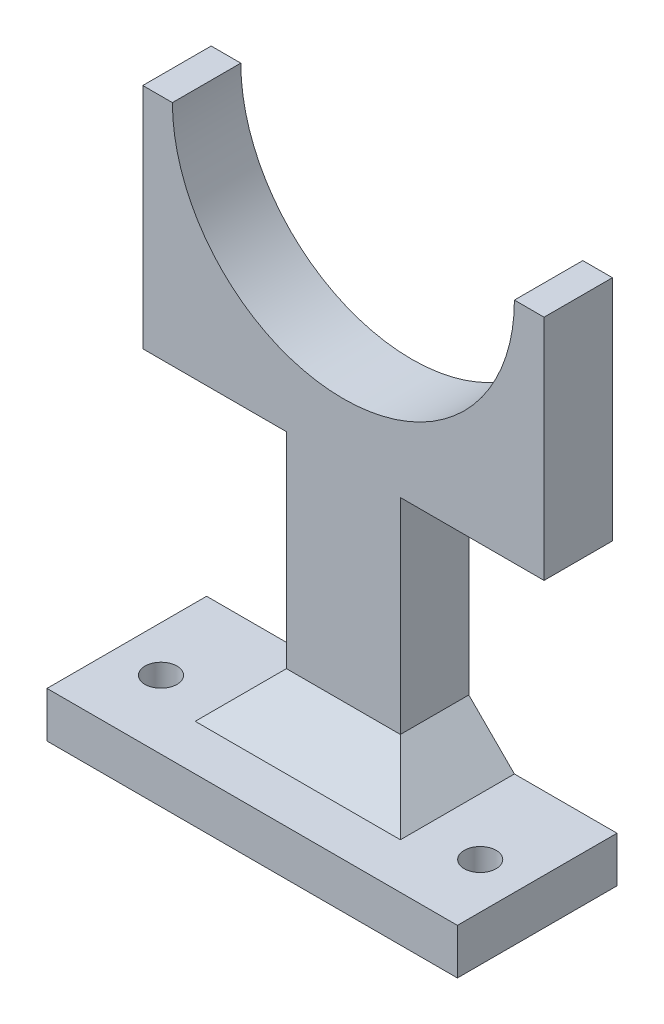
ISO-10303-21;
HEADER;
FILE_DESCRIPTION(('STEP AP214'),'2;1');
FILE_NAME('part.step','',(''),(''),'','','');
FILE_SCHEMA(('AUTOMOTIVE_DESIGN { 1 0 10303 214 1 1 1 1 }'));
ENDSEC;
DATA;
#1=APPLICATION_CONTEXT('core data for automotive mechanical design processes');
#2=APPLICATION_PROTOCOL_DEFINITION('international standard','automotive_design',2000,#1);
#3=PRODUCT_CONTEXT('',#1,'mechanical');
#4=PRODUCT('Part','Part','',(#3));
#5=PRODUCT_RELATED_PRODUCT_CATEGORY('part','',(#4));
#6=PRODUCT_DEFINITION_FORMATION('','',#4);
#7=PRODUCT_DEFINITION_CONTEXT('part definition',#1,'design');
#8=PRODUCT_DEFINITION('design','',#6,#7);
#9=PRODUCT_DEFINITION_SHAPE('','',#8);
#10=(LENGTH_UNIT() NAMED_UNIT(*) SI_UNIT(.MILLI.,.METRE.));
#11=(NAMED_UNIT(*) PLANE_ANGLE_UNIT() SI_UNIT($,.RADIAN.));
#12=(NAMED_UNIT(*) SI_UNIT($,.STERADIAN.) SOLID_ANGLE_UNIT());
#13=UNCERTAINTY_MEASURE_WITH_UNIT(LENGTH_MEASURE(1.E-05),#10,'distance_accuracy_value','');
#14=(GEOMETRIC_REPRESENTATION_CONTEXT(3) GLOBAL_UNCERTAINTY_ASSIGNED_CONTEXT((#13)) GLOBAL_UNIT_ASSIGNED_CONTEXT((#10,
#11,#12)) REPRESENTATION_CONTEXT('',''));
#15=CARTESIAN_POINT('',(0.,0.,0.));
#16=DIRECTION('',(0.,0.,1.));
#17=DIRECTION('',(1.,0.,0.));
#18=AXIS2_PLACEMENT_3D('',#15,#16,#17);
#19=CARTESIAN_POINT('',(16.6295045045046,-40.5,20.));
#20=DIRECTION('',(0.,1.,0.));
#21=DIRECTION('',(0.,0.,1.));
#22=AXIS2_PLACEMENT_3D('',#19,#20,#21);
#23=CYLINDRICAL_SURFACE('',#22,2.);
#24=CARTESIAN_POINT('',(16.6295045045046,-40.5,20.));
#25=DIRECTION('',(0.,1.,0.));
#26=DIRECTION('',(0.,0.,1.));
#27=AXIS2_PLACEMENT_3D('',#24,#25,#26);
#28=CIRCLE('',#27,2.);
#29=CARTESIAN_POINT('',(16.6295045045046,-40.5,22.));
#30=VERTEX_POINT('',#29);
#31=EDGE_CURVE('E190',#30,#30,#28,.T.);
#32=ORIENTED_EDGE('',*,*,#31,.F.);
#33=EDGE_LOOP('',(#32));
#34=FACE_BOUND('',#33,.T.);
#35=CARTESIAN_POINT('',(16.6295045045046,-37.5,20.));
#36=DIRECTION('',(0.,1.,0.));
#37=DIRECTION('',(0.,0.,1.));
#38=AXIS2_PLACEMENT_3D('',#35,#36,#37);
#39=CIRCLE('',#38,2.);
#40=CARTESIAN_POINT('',(16.6295045045046,-37.5,22.));
#41=VERTEX_POINT('',#40);
#42=EDGE_CURVE('E44',#41,#41,#39,.F.);
#43=ORIENTED_EDGE('',*,*,#42,.F.);
#44=EDGE_LOOP('',(#43));
#45=FACE_BOUND('',#44,.T.);
#46=ADVANCED_FACE('F40',(#34,#45),#23,.F.);
#47=CARTESIAN_POINT('',(-53.3704954954954,-40.5,20.));
#48=DIRECTION('',(0.,1.,0.));
#49=DIRECTION('',(0.,0.,1.));
#50=AXIS2_PLACEMENT_3D('',#47,#48,#49);
#51=CYLINDRICAL_SURFACE('',#50,2.);
#52=CARTESIAN_POINT('',(-53.3704954954954,-40.5,20.));
#53=DIRECTION('',(0.,1.,0.));
#54=DIRECTION('',(0.,0.,1.));
#55=AXIS2_PLACEMENT_3D('',#52,#53,#54);
#56=CIRCLE('',#55,2.);
#57=CARTESIAN_POINT('',(-53.3704954954954,-40.5,22.));
#58=VERTEX_POINT('',#57);
#59=EDGE_CURVE('E321',#58,#58,#56,.T.);
#60=ORIENTED_EDGE('',*,*,#59,.F.);
#61=EDGE_LOOP('',(#60));
#62=FACE_BOUND('',#61,.T.);
#63=CARTESIAN_POINT('',(-53.3704954954954,-37.5,20.));
#64=DIRECTION('',(0.,1.,0.));
#65=DIRECTION('',(0.,0.,1.));
#66=AXIS2_PLACEMENT_3D('',#63,#64,#65);
#67=CIRCLE('',#66,2.);
#68=CARTESIAN_POINT('',(-53.3704954954954,-37.5,22.));
#69=VERTEX_POINT('',#68);
#70=EDGE_CURVE('E322',#69,#69,#67,.F.);
#71=ORIENTED_EDGE('',*,*,#70,.F.);
#72=EDGE_LOOP('',(#71));
#73=FACE_BOUND('',#72,.T.);
#74=ADVANCED_FACE('F358',(#62,#73),#51,.F.);
#75=CARTESIAN_POINT('',(-18.3704954954954,74.5,15.));
#76=DIRECTION('',(0.,0.,-1.));
#77=DIRECTION('',(-1.,0.,0.));
#78=AXIS2_PLACEMENT_3D('',#75,#76,#77);
#79=CYLINDRICAL_SURFACE('',#78,37.5);
#80=CARTESIAN_POINT('',(-18.3704954954954,74.5,0.));
#81=DIRECTION('',(0.,0.,1.));
#82=DIRECTION('',(1.,0.,0.));
#83=AXIS2_PLACEMENT_3D('',#80,#81,#82);
#84=CIRCLE('',#83,37.5);
#85=CARTESIAN_POINT('',(-55.8704954954955,74.5,0.));
#86=VERTEX_POINT('',#85);
#87=CARTESIAN_POINT('',(19.1295045045046,74.5,0.));
#88=VERTEX_POINT('',#87);
#89=EDGE_CURVE('E197',#86,#88,#84,.T.);
#90=ORIENTED_EDGE('',*,*,#89,.F.);
#91=DIRECTION('',(0.,0.,-1.));
#92=VECTOR('',#91,1.);
#93=CARTESIAN_POINT('',(-55.8704954954955,74.5,15.));
#94=LINE('',#93,#92);
#95=CARTESIAN_POINT('',(-55.8704954954955,74.5,15.));
#96=VERTEX_POINT('',#95);
#97=EDGE_CURVE('E296',#96,#86,#94,.T.);
#98=ORIENTED_EDGE('',*,*,#97,.F.);
#99=CARTESIAN_POINT('',(-18.3704954954954,74.5,15.));
#100=DIRECTION('',(0.,0.,1.));
#101=DIRECTION('',(1.,0.,0.));
#102=AXIS2_PLACEMENT_3D('',#99,#100,#101);
#103=CIRCLE('',#102,37.5);
#104=CARTESIAN_POINT('',(19.1295045045046,74.5,15.));
#105=VERTEX_POINT('',#104);
#106=EDGE_CURVE('E198',#96,#105,#103,.T.);
#107=ORIENTED_EDGE('',*,*,#106,.T.);
#108=DIRECTION('',(0.,0.,-1.));
#109=VECTOR('',#108,1.);
#110=CARTESIAN_POINT('',(19.1295045045046,74.5,15.));
#111=LINE('',#110,#109);
#112=EDGE_CURVE('E264',#105,#88,#111,.T.);
#113=ORIENTED_EDGE('',*,*,#112,.T.);
#114=EDGE_LOOP('',(#90,#98,#107,#113));
#115=FACE_BOUND('',#114,.T.);
#116=ADVANCED_FACE('F380',(#115),#79,.F.);
#117=CARTESIAN_POINT('',(0.,74.5,15.));
#118=DIRECTION('',(0.,1.,0.));
#119=DIRECTION('',(0.,0.,1.));
#120=AXIS2_PLACEMENT_3D('',#117,#118,#119);
#121=PLANE('',#120);
#122=DIRECTION('',(1.,0.,0.));
#123=VECTOR('',#122,1.);
#124=CARTESIAN_POINT('',(0.,74.5,0.));
#125=LINE('',#124,#123);
#126=CARTESIAN_POINT('',(-62.3704954954954,74.5,0.));
#127=VERTEX_POINT('',#126);
#128=EDGE_CURVE('E229',#127,#86,#125,.T.);
#129=ORIENTED_EDGE('',*,*,#128,.F.);
#130=DIRECTION('',(0.,0.,-1.));
#131=VECTOR('',#130,1.);
#132=CARTESIAN_POINT('',(-62.3704954954954,74.5,15.));
#133=LINE('',#132,#131);
#134=CARTESIAN_POINT('',(-62.3704954954954,74.5,15.));
#135=VERTEX_POINT('',#134);
#136=EDGE_CURVE('E293',#135,#127,#133,.T.);
#137=ORIENTED_EDGE('',*,*,#136,.F.);
#138=DIRECTION('',(1.,0.,0.));
#139=VECTOR('',#138,1.);
#140=CARTESIAN_POINT('',(0.,74.5,15.));
#141=LINE('',#140,#139);
#142=EDGE_CURVE('E202',#135,#96,#141,.T.);
#143=ORIENTED_EDGE('',*,*,#142,.T.);
#144=ORIENTED_EDGE('',*,*,#97,.T.);
#145=EDGE_LOOP('',(#129,#137,#143,#144));
#146=FACE_BOUND('',#145,.T.);
#147=ADVANCED_FACE('F397',(#146),#121,.T.);
#148=CARTESIAN_POINT('',(-62.3704954954954,0.,15.));
#149=DIRECTION('',(1.,0.,0.));
#150=DIRECTION('',(0.,1.,0.));
#151=AXIS2_PLACEMENT_3D('',#148,#149,#150);
#152=PLANE('',#151);
#153=DIRECTION('',(0.,-1.,0.));
#154=VECTOR('',#153,1.);
#155=CARTESIAN_POINT('',(-62.3704954954954,0.,0.));
#156=LINE('',#155,#154);
#157=CARTESIAN_POINT('',(-62.3704954954954,24.5,0.));
#158=VERTEX_POINT('',#157);
#159=EDGE_CURVE('E233',#127,#158,#156,.T.);
#160=ORIENTED_EDGE('',*,*,#159,.T.);
#161=DIRECTION('',(0.,0.,-1.));
#162=VECTOR('',#161,1.);
#163=CARTESIAN_POINT('',(-62.3704954954954,24.5,15.));
#164=LINE('',#163,#162);
#165=CARTESIAN_POINT('',(-62.3704954954954,24.5,15.));
#166=VERTEX_POINT('',#165);
#167=EDGE_CURVE('E289',#166,#158,#164,.T.);
#168=ORIENTED_EDGE('',*,*,#167,.F.);
#169=DIRECTION('',(0.,-1.,0.));
#170=VECTOR('',#169,1.);
#171=CARTESIAN_POINT('',(-62.3704954954954,0.,15.));
#172=LINE('',#171,#170);
#173=EDGE_CURVE('E207',#135,#166,#172,.T.);
#174=ORIENTED_EDGE('',*,*,#173,.F.);
#175=ORIENTED_EDGE('',*,*,#136,.T.);
#176=EDGE_LOOP('',(#160,#168,#174,#175));
#177=FACE_BOUND('',#176,.T.);
#178=ADVANCED_FACE('F425',(#177),#152,.F.);
#179=CARTESIAN_POINT('',(0.,24.5,15.));
#180=DIRECTION('',(0.,1.,0.));
#181=DIRECTION('',(0.,0.,1.));
#182=AXIS2_PLACEMENT_3D('',#179,#180,#181);
#183=PLANE('',#182);
#184=DIRECTION('',(1.,0.,0.));
#185=VECTOR('',#184,1.);
#186=CARTESIAN_POINT('',(0.,24.5,0.));
#187=LINE('',#186,#185);
#188=CARTESIAN_POINT('',(-30.8704954954954,24.5,0.));
#189=VERTEX_POINT('',#188);
#190=EDGE_CURVE('E236',#158,#189,#187,.T.);
#191=ORIENTED_EDGE('',*,*,#190,.T.);
#192=DIRECTION('',(0.,0.,-1.));
#193=VECTOR('',#192,1.);
#194=CARTESIAN_POINT('',(-30.8704954954954,24.5,15.));
#195=LINE('',#194,#193);
#196=CARTESIAN_POINT('',(-30.8704954954954,24.5,15.));
#197=VERTEX_POINT('',#196);
#198=EDGE_CURVE('E285',#197,#189,#195,.T.);
#199=ORIENTED_EDGE('',*,*,#198,.F.);
#200=DIRECTION('',(1.,0.,0.));
#201=VECTOR('',#200,1.);
#202=CARTESIAN_POINT('',(0.,24.5,15.));
#203=LINE('',#202,#201);
#204=EDGE_CURVE('E211',#166,#197,#203,.T.);
#205=ORIENTED_EDGE('',*,*,#204,.F.);
#206=ORIENTED_EDGE('',*,*,#167,.T.);
#207=EDGE_LOOP('',(#191,#199,#205,#206));
#208=FACE_BOUND('',#207,.T.);
#209=ADVANCED_FACE('F406',(#208),#183,.F.);
#210=CARTESIAN_POINT('',(-30.8704954954954,0.,15.));
#211=DIRECTION('',(-1.,0.,0.));
#212=DIRECTION('',(0.,0.,1.));
#213=AXIS2_PLACEMENT_3D('',#210,#211,#212);
#214=PLANE('',#213);
#215=DIRECTION('',(0.,1.,0.));
#216=VECTOR('',#215,1.);
#217=CARTESIAN_POINT('',(-30.8704954954954,0.,0.));
#218=LINE('',#217,#216);
#219=CARTESIAN_POINT('',(-30.8704954954954,-20.5,0.));
#220=VERTEX_POINT('',#219);
#221=EDGE_CURVE('E240',#220,#189,#218,.T.);
#222=ORIENTED_EDGE('',*,*,#221,.F.);
#223=DIRECTION('',(0.,0.,1.));
#224=VECTOR('',#223,1.);
#225=CARTESIAN_POINT('',(-30.8704954954954,-20.5,15.));
#226=LINE('',#225,#224);
#227=CARTESIAN_POINT('',(-30.8704954954954,-20.5,15.));
#228=VERTEX_POINT('',#227);
#229=EDGE_CURVE('E63',#220,#228,#226,.T.);
#230=ORIENTED_EDGE('',*,*,#229,.T.);
#231=DIRECTION('',(0.,1.,0.));
#232=VECTOR('',#231,1.);
#233=CARTESIAN_POINT('',(-30.8704954954954,0.,15.));
#234=LINE('',#233,#232);
#235=EDGE_CURVE('E215',#228,#197,#234,.T.);
#236=ORIENTED_EDGE('',*,*,#235,.T.);
#237=ORIENTED_EDGE('',*,*,#198,.T.);
#238=EDGE_LOOP('',(#222,#230,#236,#237));
#239=FACE_BOUND('',#238,.T.);
#240=ADVANCED_FACE('F422',(#239),#214,.T.);
#241=CARTESIAN_POINT('',(-63.3704954954954,0.,15.));
#242=DIRECTION('',(1.,0.,0.));
#243=DIRECTION('',(0.,1.,0.));
#244=AXIS2_PLACEMENT_3D('',#241,#242,#243);
#245=PLANE('',#244);
#246=DIRECTION('',(0.,-1.,0.));
#247=VECTOR('',#246,1.);
#248=CARTESIAN_POINT('',(-63.3704954954954,0.,0.));
#249=LINE('',#248,#247);
#250=CARTESIAN_POINT('',(-63.3704954954954,-30.5,0.));
#251=VERTEX_POINT('',#250);
#252=CARTESIAN_POINT('',(-63.3704954954954,-40.5,0.));
#253=VERTEX_POINT('',#252);
#254=EDGE_CURVE('E161',#251,#253,#249,.T.);
#255=ORIENTED_EDGE('',*,*,#254,.T.);
#256=DIRECTION('',(0.,0.,-1.));
#257=VECTOR('',#256,1.);
#258=CARTESIAN_POINT('',(-63.3704954954954,-40.5,15.));
#259=LINE('',#258,#257);
#260=CARTESIAN_POINT('',(-63.3704954954954,-40.5,35.));
#261=VERTEX_POINT('',#260);
#262=EDGE_CURVE('E155',#261,#253,#259,.T.);
#263=ORIENTED_EDGE('',*,*,#262,.F.);
#264=DIRECTION('',(0.,-1.,0.));
#265=VECTOR('',#264,1.);
#266=CARTESIAN_POINT('',(-63.3704954954954,-30.5,35.));
#267=LINE('',#266,#265);
#268=CARTESIAN_POINT('',(-63.3704954954954,-30.5,35.));
#269=VERTEX_POINT('',#268);
#270=EDGE_CURVE('E159',#269,#261,#267,.T.);
#271=ORIENTED_EDGE('',*,*,#270,.F.);
#272=DIRECTION('',(0.,0.,-1.));
#273=VECTOR('',#272,1.);
#274=CARTESIAN_POINT('',(-63.3704954954954,-30.5,15.));
#275=LINE('',#274,#273);
#276=EDGE_CURVE('E166',#269,#251,#275,.T.);
#277=ORIENTED_EDGE('',*,*,#276,.T.);
#278=EDGE_LOOP('',(#255,#263,#271,#277));
#279=FACE_BOUND('',#278,.T.);
#280=ADVANCED_FACE('F157',(#279),#245,.F.);
#281=CARTESIAN_POINT('',(0.,-40.5,15.));
#282=DIRECTION('',(0.,1.,0.));
#283=DIRECTION('',(0.,0.,1.));
#284=AXIS2_PLACEMENT_3D('',#281,#282,#283);
#285=PLANE('',#284);
#286=ORIENTED_EDGE('',*,*,#59,.T.);
#287=EDGE_LOOP('',(#286));
#288=FACE_BOUND('',#287,.T.);
#289=ORIENTED_EDGE('',*,*,#31,.T.);
#290=EDGE_LOOP('',(#289));
#291=FACE_BOUND('',#290,.T.);
#292=DIRECTION('',(1.,0.,0.));
#293=VECTOR('',#292,1.);
#294=CARTESIAN_POINT('',(0.,-40.5,0.));
#295=LINE('',#294,#293);
#296=CARTESIAN_POINT('',(26.6295045045046,-40.5,0.));
#297=VERTEX_POINT('',#296);
#298=EDGE_CURVE('E250',#253,#297,#295,.T.);
#299=ORIENTED_EDGE('',*,*,#298,.T.);
#300=DIRECTION('',(0.,0.,-1.));
#301=VECTOR('',#300,1.);
#302=CARTESIAN_POINT('',(26.6295045045046,-40.5,15.));
#303=LINE('',#302,#301);
#304=CARTESIAN_POINT('',(26.6295045045046,-40.5,35.));
#305=VERTEX_POINT('',#304);
#306=EDGE_CURVE('E167',#305,#297,#303,.T.);
#307=ORIENTED_EDGE('',*,*,#306,.F.);
#308=DIRECTION('',(1.,0.,0.));
#309=VECTOR('',#308,1.);
#310=CARTESIAN_POINT('',(-63.3704954954954,-40.5,35.));
#311=LINE('',#310,#309);
#312=EDGE_CURVE('E170',#261,#305,#311,.T.);
#313=ORIENTED_EDGE('',*,*,#312,.F.);
#314=ORIENTED_EDGE('',*,*,#262,.T.);
#315=EDGE_LOOP('',(#299,#307,#313,#314));
#316=FACE_BOUND('',#315,.T.);
#317=ADVANCED_FACE('F171',(#288,#291,#316),#285,.F.);
#318=CARTESIAN_POINT('',(26.6295045045046,0.,15.));
#319=DIRECTION('',(1.,0.,0.));
#320=DIRECTION('',(0.,1.,0.));
#321=AXIS2_PLACEMENT_3D('',#318,#319,#320);
#322=PLANE('',#321);
#323=DIRECTION('',(0.,-1.,0.));
#324=VECTOR('',#323,1.);
#325=CARTESIAN_POINT('',(26.6295045045046,0.,0.));
#326=LINE('',#325,#324);
#327=CARTESIAN_POINT('',(26.6295045045046,-30.5,0.));
#328=VERTEX_POINT('',#327);
#329=EDGE_CURVE('E253',#328,#297,#326,.T.);
#330=ORIENTED_EDGE('',*,*,#329,.F.);
#331=DIRECTION('',(0.,0.,-1.));
#332=VECTOR('',#331,1.);
#333=CARTESIAN_POINT('',(26.6295045045046,-30.5,15.));
#334=LINE('',#333,#332);
#335=CARTESIAN_POINT('',(26.6295045045046,-30.5,35.));
#336=VERTEX_POINT('',#335);
#337=EDGE_CURVE('E277',#336,#328,#334,.T.);
#338=ORIENTED_EDGE('',*,*,#337,.F.);
#339=DIRECTION('',(0.,1.,0.));
#340=VECTOR('',#339,1.);
#341=CARTESIAN_POINT('',(26.6295045045046,-30.5,35.));
#342=LINE('',#341,#340);
#343=EDGE_CURVE('E176',#305,#336,#342,.T.);
#344=ORIENTED_EDGE('',*,*,#343,.F.);
#345=ORIENTED_EDGE('',*,*,#306,.T.);
#346=EDGE_LOOP('',(#330,#338,#344,#345));
#347=FACE_BOUND('',#346,.T.);
#348=ADVANCED_FACE('F413',(#347),#322,.T.);
#349=CARTESIAN_POINT('',(0.,-30.5,15.));
#350=DIRECTION('',(0.,1.,0.));
#351=DIRECTION('',(0.,0.,1.));
#352=AXIS2_PLACEMENT_3D('',#349,#350,#351);
#353=PLANE('',#352);
#354=CARTESIAN_POINT('',(-53.3704954954954,-30.5,20.));
#355=DIRECTION('',(0.,1.,0.));
#356=DIRECTION('',(0.,0.,1.));
#357=AXIS2_PLACEMENT_3D('',#354,#355,#356);
#358=CIRCLE('',#357,3.5);
#359=CARTESIAN_POINT('',(-53.3704954954954,-30.5,23.5));
#360=VERTEX_POINT('',#359);
#361=EDGE_CURVE('E332',#360,#360,#358,.T.);
#362=ORIENTED_EDGE('',*,*,#361,.F.);
#363=EDGE_LOOP('',(#362));
#364=FACE_BOUND('',#363,.T.);
#365=CARTESIAN_POINT('',(16.6295045045046,-30.5,20.));
#366=DIRECTION('',(0.,1.,0.));
#367=DIRECTION('',(0.,0.,1.));
#368=AXIS2_PLACEMENT_3D('',#365,#366,#367);
#369=CIRCLE('',#368,3.5);
#370=CARTESIAN_POINT('',(16.6295045045046,-30.5,23.5));
#371=VERTEX_POINT('',#370);
#372=EDGE_CURVE('E344',#371,#371,#369,.T.);
#373=ORIENTED_EDGE('',*,*,#372,.F.);
#374=EDGE_LOOP('',(#373));
#375=FACE_BOUND('',#374,.T.);
#376=DIRECTION('',(1.,0.,0.));
#377=VECTOR('',#376,1.);
#378=CARTESIAN_POINT('',(0.,-30.5,0.));
#379=LINE('',#378,#377);
#380=CARTESIAN_POINT('',(4.12950450450465,-30.5,0.));
#381=VERTEX_POINT('',#380);
#382=EDGE_CURVE('E247',#381,#328,#379,.T.);
#383=ORIENTED_EDGE('',*,*,#382,.F.);
#384=DIRECTION('',(0.,0.,1.));
#385=VECTOR('',#384,1.);
#386=CARTESIAN_POINT('',(4.12950450450465,-30.5,15.));
#387=LINE('',#386,#385);
#388=CARTESIAN_POINT('',(4.12950450450465,-30.5,25.0000000000001));
#389=VERTEX_POINT('',#388);
#390=EDGE_CURVE('E309',#381,#389,#387,.T.);
#391=ORIENTED_EDGE('',*,*,#390,.T.);
#392=DIRECTION('',(-1.,0.,0.));
#393=VECTOR('',#392,1.);
#394=CARTESIAN_POINT('',(-30.8704954954954,-30.5,25.0000000000001));
#395=LINE('',#394,#393);
#396=CARTESIAN_POINT('',(-40.8704954954955,-30.5,25.0000000000001));
#397=VERTEX_POINT('',#396);
#398=EDGE_CURVE('E306',#389,#397,#395,.T.);
#399=ORIENTED_EDGE('',*,*,#398,.T.);
#400=DIRECTION('',(0.,0.,-1.));
#401=VECTOR('',#400,1.);
#402=CARTESIAN_POINT('',(-40.8704954954955,-30.5,0.));
#403=LINE('',#402,#401);
#404=CARTESIAN_POINT('',(-40.8704954954955,-30.5,0.));
#405=VERTEX_POINT('',#404);
#406=EDGE_CURVE('E303',#397,#405,#403,.T.);
#407=ORIENTED_EDGE('',*,*,#406,.T.);
#408=EDGE_CURVE('E244',#251,#405,#379,.T.);
#409=ORIENTED_EDGE('',*,*,#408,.F.);
#410=ORIENTED_EDGE('',*,*,#276,.F.);
#411=DIRECTION('',(-1.,0.,0.));
#412=VECTOR('',#411,1.);
#413=CARTESIAN_POINT('',(-63.3704954954954,-30.5,35.));
#414=LINE('',#413,#412);
#415=EDGE_CURVE('E181',#336,#269,#414,.T.);
#416=ORIENTED_EDGE('',*,*,#415,.F.);
#417=ORIENTED_EDGE('',*,*,#337,.T.);
#418=EDGE_LOOP('',(#383,#391,#399,#407,#409,#410,#416,#417));
#419=FACE_BOUND('',#418,.T.);
#420=ADVANCED_FACE('F409',(#364,#375,#419),#353,.T.);
#421=CARTESIAN_POINT('',(-5.87049549549543,0.,15.));
#422=DIRECTION('',(-1.,0.,0.));
#423=DIRECTION('',(0.,0.,1.));
#424=AXIS2_PLACEMENT_3D('',#421,#422,#423);
#425=PLANE('',#424);
#426=DIRECTION('',(0.,1.,0.));
#427=VECTOR('',#426,1.);
#428=CARTESIAN_POINT('',(-5.87049549549543,0.,15.));
#429=LINE('',#428,#427);
#430=CARTESIAN_POINT('',(-5.87049549549543,-20.5,15.));
#431=VERTEX_POINT('',#430);
#432=CARTESIAN_POINT('',(-5.87049549549543,24.5,15.));
#433=VERTEX_POINT('',#432);
#434=EDGE_CURVE('E219',#431,#433,#429,.T.);
#435=ORIENTED_EDGE('',*,*,#434,.F.);
#436=DIRECTION('',(0.,0.,-1.));
#437=VECTOR('',#436,1.);
#438=CARTESIAN_POINT('',(-5.87049549549543,-20.5,15.));
#439=LINE('',#438,#437);
#440=CARTESIAN_POINT('',(-5.87049549549543,-20.5,0.));
#441=VERTEX_POINT('',#440);
#442=EDGE_CURVE('E299',#431,#441,#439,.T.);
#443=ORIENTED_EDGE('',*,*,#442,.T.);
#444=DIRECTION('',(0.,1.,0.));
#445=VECTOR('',#444,1.);
#446=CARTESIAN_POINT('',(-5.87049549549543,0.,0.));
#447=LINE('',#446,#445);
#448=CARTESIAN_POINT('',(-5.87049549549543,24.5,0.));
#449=VERTEX_POINT('',#448);
#450=EDGE_CURVE('E257',#441,#449,#447,.T.);
#451=ORIENTED_EDGE('',*,*,#450,.T.);
#452=DIRECTION('',(0.,0.,-1.));
#453=VECTOR('',#452,1.);
#454=CARTESIAN_POINT('',(-5.87049549549543,24.5,15.));
#455=LINE('',#454,#453);
#456=EDGE_CURVE('E273',#433,#449,#455,.T.);
#457=ORIENTED_EDGE('',*,*,#456,.F.);
#458=EDGE_LOOP('',(#435,#443,#451,#457));
#459=FACE_BOUND('',#458,.T.);
#460=ADVANCED_FACE('F404',(#459),#425,.F.);
#461=CARTESIAN_POINT('',(25.6295045045045,24.5,0.));
#462=VERTEX_POINT('',#461);
#463=EDGE_CURVE('E241',#449,#462,#187,.T.);
#464=ORIENTED_EDGE('',*,*,#463,.T.);
#465=DIRECTION('',(0.,0.,-1.));
#466=VECTOR('',#465,1.);
#467=CARTESIAN_POINT('',(25.6295045045045,24.5,15.));
#468=LINE('',#467,#466);
#469=CARTESIAN_POINT('',(25.6295045045045,24.5,15.));
#470=VERTEX_POINT('',#469);
#471=EDGE_CURVE('E270',#470,#462,#468,.T.);
#472=ORIENTED_EDGE('',*,*,#471,.F.);
#473=EDGE_CURVE('E216',#433,#470,#203,.T.);
#474=ORIENTED_EDGE('',*,*,#473,.F.);
#475=ORIENTED_EDGE('',*,*,#456,.T.);
#476=EDGE_LOOP('',(#464,#472,#474,#475));
#477=FACE_BOUND('',#476,.T.);
#478=ADVANCED_FACE('F400',(#477),#183,.F.);
#479=CARTESIAN_POINT('',(25.6295045045045,0.,15.));
#480=DIRECTION('',(1.,0.,0.));
#481=DIRECTION('',(0.,1.,0.));
#482=AXIS2_PLACEMENT_3D('',#479,#480,#481);
#483=PLANE('',#482);
#484=DIRECTION('',(0.,-1.,0.));
#485=VECTOR('',#484,1.);
#486=CARTESIAN_POINT('',(25.6295045045045,0.,0.));
#487=LINE('',#486,#485);
#488=CARTESIAN_POINT('',(25.6295045045046,74.5,0.));
#489=VERTEX_POINT('',#488);
#490=EDGE_CURVE('E260',#489,#462,#487,.T.);
#491=ORIENTED_EDGE('',*,*,#490,.F.);
#492=DIRECTION('',(0.,0.,-1.));
#493=VECTOR('',#492,1.);
#494=CARTESIAN_POINT('',(25.6295045045046,74.5,15.));
#495=LINE('',#494,#493);
#496=CARTESIAN_POINT('',(25.6295045045046,74.5,15.));
#497=VERTEX_POINT('',#496);
#498=EDGE_CURVE('E267',#497,#489,#495,.T.);
#499=ORIENTED_EDGE('',*,*,#498,.F.);
#500=DIRECTION('',(0.,-1.,0.));
#501=VECTOR('',#500,1.);
#502=CARTESIAN_POINT('',(25.6295045045045,0.,15.));
#503=LINE('',#502,#501);
#504=EDGE_CURVE('E222',#497,#470,#503,.T.);
#505=ORIENTED_EDGE('',*,*,#504,.T.);
#506=ORIENTED_EDGE('',*,*,#471,.T.);
#507=EDGE_LOOP('',(#491,#499,#505,#506));
#508=FACE_BOUND('',#507,.T.);
#509=ADVANCED_FACE('F395',(#508),#483,.T.);
#510=EDGE_CURVE('E203',#88,#489,#125,.T.);
#511=ORIENTED_EDGE('',*,*,#510,.F.);
#512=ORIENTED_EDGE('',*,*,#112,.F.);
#513=EDGE_CURVE('E208',#105,#497,#141,.T.);
#514=ORIENTED_EDGE('',*,*,#513,.T.);
#515=ORIENTED_EDGE('',*,*,#498,.T.);
#516=EDGE_LOOP('',(#511,#512,#514,#515));
#517=FACE_BOUND('',#516,.T.);
#518=ADVANCED_FACE('F389',(#517),#121,.T.);
#519=CARTESIAN_POINT('',(0.,0.,15.));
#520=DIRECTION('',(0.,0.,1.));
#521=DIRECTION('',(1.,0.,0.));
#522=AXIS2_PLACEMENT_3D('',#519,#520,#521);
#523=PLANE('',#522);
#524=ORIENTED_EDGE('',*,*,#235,.F.);
#525=DIRECTION('',(1.,0.,0.));
#526=VECTOR('',#525,1.);
#527=CARTESIAN_POINT('',(-5.87049549549546,-20.5,15.));
#528=LINE('',#527,#526);
#529=EDGE_CURVE('E312',#228,#431,#528,.T.);
#530=ORIENTED_EDGE('',*,*,#529,.T.);
#531=ORIENTED_EDGE('',*,*,#434,.T.);
#532=ORIENTED_EDGE('',*,*,#473,.T.);
#533=ORIENTED_EDGE('',*,*,#504,.F.);
#534=ORIENTED_EDGE('',*,*,#513,.F.);
#535=ORIENTED_EDGE('',*,*,#106,.F.);
#536=ORIENTED_EDGE('',*,*,#142,.F.);
#537=ORIENTED_EDGE('',*,*,#173,.T.);
#538=ORIENTED_EDGE('',*,*,#204,.T.);
#539=EDGE_LOOP('',(#524,#530,#531,#532,#533,#534,#535,#536,#537,#538));
#540=FACE_BOUND('',#539,.T.);
#541=ADVANCED_FACE('F386',(#540),#523,.T.);
#542=CARTESIAN_POINT('',(0.,0.,0.));
#543=DIRECTION('',(0.,0.,1.));
#544=DIRECTION('',(1.,0.,0.));
#545=AXIS2_PLACEMENT_3D('',#542,#543,#544);
#546=PLANE('',#545);
#547=ORIENTED_EDGE('',*,*,#89,.T.);
#548=ORIENTED_EDGE('',*,*,#510,.T.);
#549=ORIENTED_EDGE('',*,*,#490,.T.);
#550=ORIENTED_EDGE('',*,*,#463,.F.);
#551=ORIENTED_EDGE('',*,*,#450,.F.);
#552=DIRECTION('',(0.707106781186551,-0.707106781186544,0.));
#553=VECTOR('',#552,1.);
#554=CARTESIAN_POINT('',(-13.1852477477477,-13.1852477477479,0.));
#555=LINE('',#554,#553);
#556=EDGE_CURVE('E50',#441,#381,#555,.T.);
#557=ORIENTED_EDGE('',*,*,#556,.T.);
#558=ORIENTED_EDGE('',*,*,#382,.T.);
#559=ORIENTED_EDGE('',*,*,#329,.T.);
#560=ORIENTED_EDGE('',*,*,#298,.F.);
#561=ORIENTED_EDGE('',*,*,#254,.F.);
#562=ORIENTED_EDGE('',*,*,#408,.T.);
#563=DIRECTION('',(-0.707106781186551,-0.707106781186544,0.));
#564=VECTOR('',#563,1.);
#565=CARTESIAN_POINT('',(-5.18524774774752,5.18524774774758,0.));
#566=LINE('',#565,#564);
#567=EDGE_CURVE('E11',#405,#220,#566,.F.);
#568=ORIENTED_EDGE('',*,*,#567,.T.);
#569=ORIENTED_EDGE('',*,*,#221,.T.);
#570=ORIENTED_EDGE('',*,*,#190,.F.);
#571=ORIENTED_EDGE('',*,*,#159,.F.);
#572=ORIENTED_EDGE('',*,*,#128,.T.);
#573=EDGE_LOOP('',(#547,#548,#549,#550,#551,#557,#558,#559,#560,#561,#562,#568,#569,#570,#571,#572));
#574=FACE_BOUND('',#573,.T.);
#575=ADVANCED_FACE('F385',(#574),#546,.F.);
#576=CARTESIAN_POINT('',(0.,0.,35.));
#577=DIRECTION('',(0.,0.,1.));
#578=DIRECTION('',(1.,0.,0.));
#579=AXIS2_PLACEMENT_3D('',#576,#577,#578);
#580=PLANE('',#579);
#581=ORIENTED_EDGE('',*,*,#270,.T.);
#582=ORIENTED_EDGE('',*,*,#312,.T.);
#583=ORIENTED_EDGE('',*,*,#343,.T.);
#584=ORIENTED_EDGE('',*,*,#415,.T.);
#585=EDGE_LOOP('',(#581,#582,#583,#584));
#586=FACE_BOUND('',#585,.T.);
#587=ADVANCED_FACE('F179',(#586),#580,.T.);
#588=CARTESIAN_POINT('',(-40.8704954954955,-30.5,15.));
#589=DIRECTION('',(-0.707106781186544,0.707106781186552,0.));
#590=DIRECTION('',(0.,0.,1.));
#591=AXIS2_PLACEMENT_3D('',#588,#589,#590);
#592=PLANE('',#591);
#593=ORIENTED_EDGE('',*,*,#567,.F.);
#594=ORIENTED_EDGE('',*,*,#406,.F.);
#595=DIRECTION('',(0.577350269189628,0.577350269189622,-0.577350269189628));
#596=VECTOR('',#595,1.);
#597=CARTESIAN_POINT('',(-37.5371621621621,-27.1666666666667,21.6666666666667));
#598=LINE('',#597,#596);
#599=EDGE_CURVE('E183',#228,#397,#598,.F.);
#600=ORIENTED_EDGE('',*,*,#599,.F.);
#601=ORIENTED_EDGE('',*,*,#229,.F.);
#602=EDGE_LOOP('',(#593,#594,#600,#601));
#603=FACE_BOUND('',#602,.T.);
#604=ADVANCED_FACE('F42',(#603),#592,.T.);
#605=CARTESIAN_POINT('',(0.,-30.5,25.0000000000001));
#606=DIRECTION('',(0.,0.707106781186552,0.707106781186544));
#607=DIRECTION('',(1.,0.,0.));
#608=AXIS2_PLACEMENT_3D('',#605,#606,#607);
#609=PLANE('',#608);
#610=ORIENTED_EDGE('',*,*,#599,.T.);
#611=ORIENTED_EDGE('',*,*,#398,.F.);
#612=DIRECTION('',(0.577350269189628,-0.577350269189622,0.577350269189628));
#613=VECTOR('',#612,1.);
#614=CARTESIAN_POINT('',(2.75300300300309,-29.1234984984985,23.6234984984985));
#615=LINE('',#614,#613);
#616=EDGE_CURVE('E187',#431,#389,#615,.T.);
#617=ORIENTED_EDGE('',*,*,#616,.F.);
#618=ORIENTED_EDGE('',*,*,#529,.F.);
#619=EDGE_LOOP('',(#610,#611,#617,#618));
#620=FACE_BOUND('',#619,.T.);
#621=ADVANCED_FACE('F434',(#620),#609,.T.);
#622=CARTESIAN_POINT('',(-5.87049549549543,-20.5,15.));
#623=DIRECTION('',(-0.707106781186544,-0.707106781186552,0.));
#624=DIRECTION('',(0.,0.,-1.));
#625=AXIS2_PLACEMENT_3D('',#622,#623,#624);
#626=PLANE('',#625);
#627=ORIENTED_EDGE('',*,*,#616,.T.);
#628=ORIENTED_EDGE('',*,*,#390,.F.);
#629=ORIENTED_EDGE('',*,*,#556,.F.);
#630=ORIENTED_EDGE('',*,*,#442,.F.);
#631=EDGE_LOOP('',(#627,#628,#629,#630));
#632=FACE_BOUND('',#631,.T.);
#633=ADVANCED_FACE('F432',(#632),#626,.F.);
#634=CARTESIAN_POINT('',(-53.3704954954954,-37.5,20.));
#635=DIRECTION('',(0.,1.,0.));
#636=DIRECTION('',(0.,0.,1.));
#637=AXIS2_PLACEMENT_3D('',#634,#635,#636);
#638=PLANE('',#637);
#639=CARTESIAN_POINT('',(-53.3704954954954,-37.5,20.));
#640=DIRECTION('',(0.,1.,0.));
#641=DIRECTION('',(0.,0.,1.));
#642=AXIS2_PLACEMENT_3D('',#639,#640,#641);
#643=CIRCLE('',#642,3.5);
#644=CARTESIAN_POINT('',(-53.3704954954954,-37.5,23.5));
#645=VERTEX_POINT('',#644);
#646=EDGE_CURVE('E325',#645,#645,#643,.T.);
#647=ORIENTED_EDGE('',*,*,#646,.T.);
#648=EDGE_LOOP('',(#647));
#649=FACE_BOUND('',#648,.T.);
#650=ORIENTED_EDGE('',*,*,#70,.T.);
#651=EDGE_LOOP('',(#650));
#652=FACE_BOUND('',#651,.T.);
#653=ADVANCED_FACE('F374',(#649,#652),#638,.T.);
#654=CARTESIAN_POINT('',(-53.3704954954954,-37.5,20.));
#655=DIRECTION('',(0.,1.,0.));
#656=DIRECTION('',(0.,0.,1.));
#657=AXIS2_PLACEMENT_3D('',#654,#655,#656);
#658=CYLINDRICAL_SURFACE('',#657,3.5);
#659=ORIENTED_EDGE('',*,*,#646,.F.);
#660=EDGE_LOOP('',(#659));
#661=FACE_BOUND('',#660,.T.);
#662=ORIENTED_EDGE('',*,*,#361,.T.);
#663=EDGE_LOOP('',(#662));
#664=FACE_BOUND('',#663,.T.);
#665=ADVANCED_FACE('F365',(#661,#664),#658,.F.);
#666=CARTESIAN_POINT('',(16.6295045045046,-37.5,20.));
#667=DIRECTION('',(0.,1.,0.));
#668=DIRECTION('',(0.,0.,1.));
#669=AXIS2_PLACEMENT_3D('',#666,#667,#668);
#670=PLANE('',#669);
#671=CARTESIAN_POINT('',(16.6295045045046,-37.5,20.));
#672=DIRECTION('',(0.,1.,0.));
#673=DIRECTION('',(0.,0.,1.));
#674=AXIS2_PLACEMENT_3D('',#671,#672,#673);
#675=CIRCLE('',#674,3.5);
#676=CARTESIAN_POINT('',(16.6295045045046,-37.5,23.5));
#677=VERTEX_POINT('',#676);
#678=EDGE_CURVE('E338',#677,#677,#675,.T.);
#679=ORIENTED_EDGE('',*,*,#678,.T.);
#680=EDGE_LOOP('',(#679));
#681=FACE_BOUND('',#680,.T.);
#682=ORIENTED_EDGE('',*,*,#42,.T.);
#683=EDGE_LOOP('',(#682));
#684=FACE_BOUND('',#683,.T.);
#685=ADVANCED_FACE('F362',(#681,#684),#670,.T.);
#686=CARTESIAN_POINT('',(16.6295045045046,-37.5,20.));
#687=DIRECTION('',(0.,1.,0.));
#688=DIRECTION('',(0.,0.,1.));
#689=AXIS2_PLACEMENT_3D('',#686,#687,#688);
#690=CYLINDRICAL_SURFACE('',#689,3.5);
#691=ORIENTED_EDGE('',*,*,#678,.F.);
#692=EDGE_LOOP('',(#691));
#693=FACE_BOUND('',#692,.T.);
#694=ORIENTED_EDGE('',*,*,#372,.T.);
#695=EDGE_LOOP('',(#694));
#696=FACE_BOUND('',#695,.T.);
#697=ADVANCED_FACE('F364',(#693,#696),#690,.F.);
#698=CLOSED_SHELL('',(#46,#74,#116,#147,#178,#209,#240,#280,#317,#348,#420,#460,#478,#509,#518,
#541,#575,#587,#604,#621,#633,#653,#665,#685,#697));
#699=MANIFOLD_SOLID_BREP('B2',#698);
#700=ADVANCED_BREP_SHAPE_REPRESENTATION('',(#18,#699),#14);
#701=SHAPE_DEFINITION_REPRESENTATION(#9,#700);
ENDSEC;
END-ISO-10303-21;
